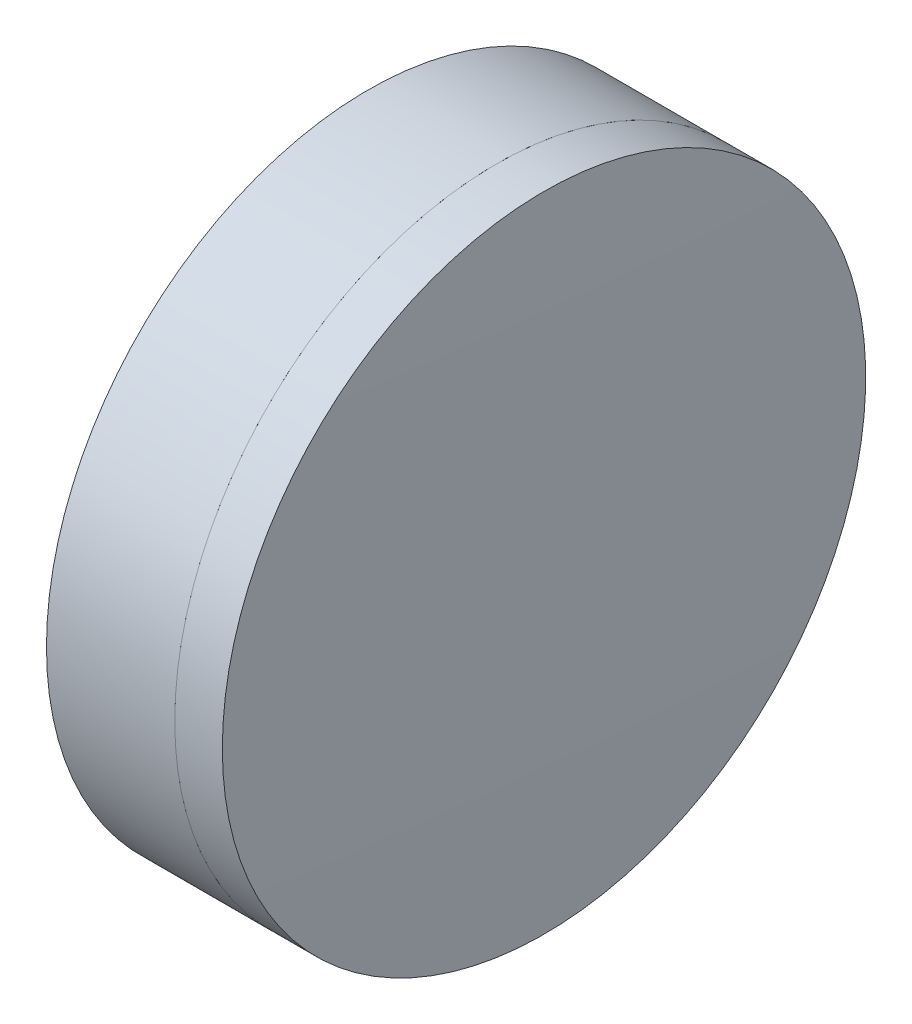
ISO-10303-21;
HEADER;
FILE_DESCRIPTION(('STEP AP214'),'2;1');
FILE_NAME('part.step','',(''),(''),'','','');
FILE_SCHEMA(('AUTOMOTIVE_DESIGN { 1 0 10303 214 1 1 1 1 }'));
ENDSEC;
DATA;
#1=APPLICATION_CONTEXT('core data for automotive mechanical design processes');
#2=APPLICATION_PROTOCOL_DEFINITION('international standard','automotive_design',2000,#1);
#3=PRODUCT_CONTEXT('',#1,'mechanical');
#4=PRODUCT('Part','Part','',(#3));
#5=PRODUCT_RELATED_PRODUCT_CATEGORY('part','',(#4));
#6=PRODUCT_DEFINITION_FORMATION('','',#4);
#7=PRODUCT_DEFINITION_CONTEXT('part definition',#1,'design');
#8=PRODUCT_DEFINITION('design','',#6,#7);
#9=PRODUCT_DEFINITION_SHAPE('','',#8);
#10=(LENGTH_UNIT() NAMED_UNIT(*) SI_UNIT(.MILLI.,.METRE.));
#11=(NAMED_UNIT(*) PLANE_ANGLE_UNIT() SI_UNIT($,.RADIAN.));
#12=(NAMED_UNIT(*) SI_UNIT($,.STERADIAN.) SOLID_ANGLE_UNIT());
#13=UNCERTAINTY_MEASURE_WITH_UNIT(LENGTH_MEASURE(1.E-05),#10,'distance_accuracy_value','');
#14=(GEOMETRIC_REPRESENTATION_CONTEXT(3) GLOBAL_UNCERTAINTY_ASSIGNED_CONTEXT((#13)) GLOBAL_UNIT_ASSIGNED_CONTEXT((#10,
#11,#12)) REPRESENTATION_CONTEXT('',''));
#15=CARTESIAN_POINT('',(0.,0.,0.));
#16=DIRECTION('',(0.,0.,1.));
#17=DIRECTION('',(1.,0.,0.));
#18=AXIS2_PLACEMENT_3D('',#15,#16,#17);
#19=CARTESIAN_POINT('',(203.78875444623,0.,0.));
#20=DIRECTION('',(-1.,0.,0.));
#21=DIRECTION('',(0.,0.,1.));
#22=AXIS2_PLACEMENT_3D('',#19,#20,#21);
#23=SPHERICAL_SURFACE('',#22,59.);
#24=CARTESIAN_POINT('',(146.171829849373,0.,0.));
#25=DIRECTION('',(-1.,0.,0.));
#26=DIRECTION('',(0.,0.,1.));
#27=AXIS2_PLACEMENT_3D('',#24,#25,#26);
#28=CIRCLE('',#27,12.6999999999999);
#29=CARTESIAN_POINT('',(146.171829849373,0.,12.6999999999999));
#30=VERTEX_POINT('',#29);
#31=EDGE_CURVE('E11',#30,#30,#28,.T.);
#32=ORIENTED_EDGE('',*,*,#31,.T.);
#33=EDGE_LOOP('',(#32));
#34=FACE_BOUND('',#33,.T.);
#35=ADVANCED_FACE('F45',(#34),#23,.T.);
#36=CARTESIAN_POINT('',(141.107222163252,0.,0.));
#37=DIRECTION('',(-1.,0.,0.));
#38=DIRECTION('',(0.,0.,1.));
#39=AXIS2_PLACEMENT_3D('',#36,#37,#38);
#40=CYLINDRICAL_SURFACE('',#39,12.6999999999999);
#41=CARTESIAN_POINT('',(148.049886260647,0.,0.));
#42=DIRECTION('',(-1.,0.,0.));
#43=DIRECTION('',(0.,0.,1.));
#44=AXIS2_PLACEMENT_3D('',#41,#42,#43);
#45=CIRCLE('',#44,12.6999999999999);
#46=CARTESIAN_POINT('',(148.049886260647,0.,12.6999999999999));
#47=VERTEX_POINT('',#46);
#48=EDGE_CURVE('E51',#47,#47,#45,.T.);
#49=ORIENTED_EDGE('',*,*,#48,.T.);
#50=EDGE_LOOP('',(#49));
#51=FACE_BOUND('',#50,.T.);
#52=ORIENTED_EDGE('',*,*,#31,.F.);
#53=EDGE_LOOP('',(#52));
#54=FACE_BOUND('',#53,.T.);
#55=ADVANCED_FACE('F57',(#51,#54),#40,.T.);
#56=CARTESIAN_POINT('',(-432.61124555377,0.,0.));
#57=DIRECTION('',(-1.,0.,0.));
#58=DIRECTION('',(0.,0.,1.));
#59=AXIS2_PLACEMENT_3D('',#56,#57,#58);
#60=SPHERICAL_SURFACE('',#59,580.8);
#61=ORIENTED_EDGE('',*,*,#48,.F.);
#62=EDGE_LOOP('',(#61));
#63=FACE_BOUND('',#62,.T.);
#64=ADVANCED_FACE('F60',(#63),#60,.T.);
#65=CLOSED_SHELL('',(#35,#55,#64));
#66=MANIFOLD_SOLID_BREP('B2',#65);
#67=CARTESIAN_POINT('',(93.9887544462303,0.,0.));
#68=DIRECTION('',(-1.,0.,0.));
#69=DIRECTION('',(0.,0.,1.));
#70=AXIS2_PLACEMENT_3D('',#67,#68,#69);
#71=SPHERICAL_SURFACE('',#70,48.8);
#72=CARTESIAN_POINT('',(141.107222163252,0.,0.));
#73=DIRECTION('',(-1.,0.,0.));
#74=DIRECTION('',(0.,0.,1.));
#75=AXIS2_PLACEMENT_3D('',#72,#73,#74);
#76=CIRCLE('',#75,12.7);
#77=CARTESIAN_POINT('',(141.107222163252,0.,12.6999999999999));
#78=VERTEX_POINT('',#77);
#79=EDGE_CURVE('E44',#78,#78,#76,.T.);
#80=ORIENTED_EDGE('',*,*,#79,.T.);
#81=EDGE_LOOP('',(#80));
#82=FACE_BOUND('',#81,.T.);
#83=ADVANCED_FACE('F86',(#82),#71,.F.);
#84=CARTESIAN_POINT('',(-185.274474050658,0.,0.));
#85=DIRECTION('',(-1.,0.,0.));
#86=DIRECTION('',(0.,0.,1.));
#87=AXIS2_PLACEMENT_3D('',#84,#85,#86);
#88=CYLINDRICAL_SURFACE('',#87,12.7);
#89=CARTESIAN_POINT('',(146.171829849373,0.,0.));
#90=DIRECTION('',(-1.,0.,0.));
#91=DIRECTION('',(0.,0.,1.));
#92=AXIS2_PLACEMENT_3D('',#89,#90,#91);
#93=CIRCLE('',#92,12.7);
#94=CARTESIAN_POINT('',(146.171829849373,0.,12.6999999999999));
#95=VERTEX_POINT('',#94);
#96=EDGE_CURVE('E92',#95,#95,#93,.T.);
#97=ORIENTED_EDGE('',*,*,#96,.T.);
#98=EDGE_LOOP('',(#97));
#99=FACE_BOUND('',#98,.T.);
#100=ORIENTED_EDGE('',*,*,#79,.F.);
#101=EDGE_LOOP('',(#100));
#102=FACE_BOUND('',#101,.T.);
#103=ADVANCED_FACE('F98',(#99,#102),#88,.T.);
#104=CARTESIAN_POINT('',(203.78875444623,0.,0.));
#105=DIRECTION('',(-1.,0.,0.));
#106=DIRECTION('',(0.,0.,-1.));
#107=AXIS2_PLACEMENT_3D('',#104,#105,#106);
#108=SPHERICAL_SURFACE('',#107,59.);
#109=ORIENTED_EDGE('',*,*,#96,.F.);
#110=EDGE_LOOP('',(#109));
#111=FACE_BOUND('',#110,.T.);
#112=ADVANCED_FACE('F101',(#111),#108,.F.);
#113=CLOSED_SHELL('',(#83,#103,#112));
#114=MANIFOLD_SOLID_BREP('B6',#113);
#115=ADVANCED_BREP_SHAPE_REPRESENTATION('',(#18,#66,#114),#14);
#116=SHAPE_DEFINITION_REPRESENTATION(#9,#115);
ENDSEC;
END-ISO-10303-21;
